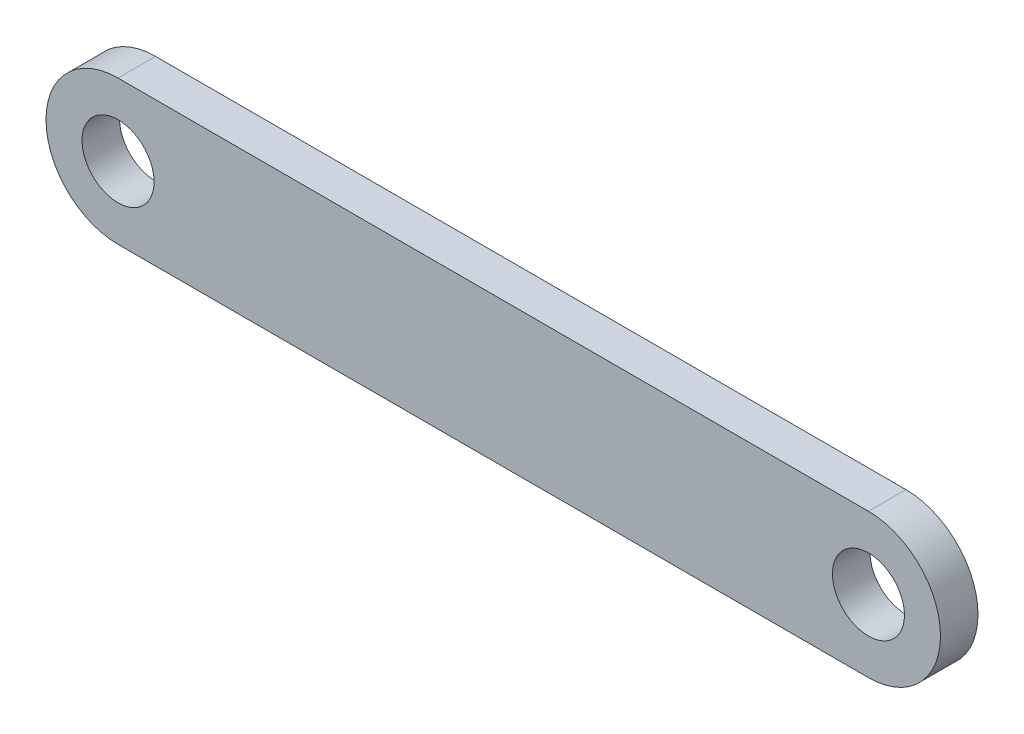
ISO-10303-21;
HEADER;
FILE_DESCRIPTION(('STEP AP214'),'2;1');
FILE_NAME('part.step','',(''),(''),'','','');
FILE_SCHEMA(('AUTOMOTIVE_DESIGN { 1 0 10303 214 1 1 1 1 }'));
ENDSEC;
DATA;
#1=APPLICATION_CONTEXT('core data for automotive mechanical design processes');
#2=APPLICATION_PROTOCOL_DEFINITION('international standard','automotive_design',2000,#1);
#3=PRODUCT_CONTEXT('',#1,'mechanical');
#4=PRODUCT('Part','Part','',(#3));
#5=PRODUCT_RELATED_PRODUCT_CATEGORY('part','',(#4));
#6=PRODUCT_DEFINITION_FORMATION('','',#4);
#7=PRODUCT_DEFINITION_CONTEXT('part definition',#1,'design');
#8=PRODUCT_DEFINITION('design','',#6,#7);
#9=PRODUCT_DEFINITION_SHAPE('','',#8);
#10=(LENGTH_UNIT() NAMED_UNIT(*) SI_UNIT(.MILLI.,.METRE.));
#11=(NAMED_UNIT(*) PLANE_ANGLE_UNIT() SI_UNIT($,.RADIAN.));
#12=(NAMED_UNIT(*) SI_UNIT($,.STERADIAN.) SOLID_ANGLE_UNIT());
#13=UNCERTAINTY_MEASURE_WITH_UNIT(LENGTH_MEASURE(1.E-05),#10,'distance_accuracy_value','');
#14=(GEOMETRIC_REPRESENTATION_CONTEXT(3) GLOBAL_UNCERTAINTY_ASSIGNED_CONTEXT((#13)) GLOBAL_UNIT_ASSIGNED_CONTEXT((#10,
#11,#12)) REPRESENTATION_CONTEXT('',''));
#15=CARTESIAN_POINT('',(0.,0.,0.));
#16=DIRECTION('',(0.,0.,1.));
#17=DIRECTION('',(1.,0.,0.));
#18=AXIS2_PLACEMENT_3D('',#15,#16,#17);
#19=CARTESIAN_POINT('',(0.,0.,3.125));
#20=DIRECTION('',(0.,0.,1.));
#21=DIRECTION('',(1.,0.,0.));
#22=AXIS2_PLACEMENT_3D('',#19,#20,#21);
#23=PLANE('',#22);
#24=CARTESIAN_POINT('',(0.,0.,3.125));
#25=DIRECTION('',(0.,0.,1.));
#26=DIRECTION('',(1.,0.,0.));
#27=AXIS2_PLACEMENT_3D('',#24,#25,#26);
#28=CIRCLE('',#27,6.);
#29=CARTESIAN_POINT('',(6.,0.,3.125));
#30=VERTEX_POINT('',#29);
#31=EDGE_CURVE('E102',#30,#30,#28,.T.);
#32=ORIENTED_EDGE('',*,*,#31,.F.);
#33=EDGE_LOOP('',(#32));
#34=FACE_BOUND('',#33,.T.);
#35=CARTESIAN_POINT('',(0.,0.,3.125));
#36=DIRECTION('',(0.,0.,1.));
#37=DIRECTION('',(1.,0.,0.));
#38=AXIS2_PLACEMENT_3D('',#35,#36,#37);
#39=CIRCLE('',#38,12.);
#40=CARTESIAN_POINT('',(0.,12.,3.125));
#41=VERTEX_POINT('',#40);
#42=CARTESIAN_POINT('',(0.,-12.,3.125));
#43=VERTEX_POINT('',#42);
#44=EDGE_CURVE('E87',#41,#43,#39,.T.);
#45=ORIENTED_EDGE('',*,*,#44,.T.);
#46=DIRECTION('',(1.,0.,0.));
#47=VECTOR('',#46,1.);
#48=CARTESIAN_POINT('',(0.,-12.,3.125));
#49=LINE('',#48,#47);
#50=CARTESIAN_POINT('',(125.,-12.,3.125));
#51=VERTEX_POINT('',#50);
#52=EDGE_CURVE('E82',#43,#51,#49,.T.);
#53=ORIENTED_EDGE('',*,*,#52,.T.);
#54=CARTESIAN_POINT('',(125.,0.,3.125));
#55=DIRECTION('',(0.,0.,1.));
#56=DIRECTION('',(1.,0.,0.));
#57=AXIS2_PLACEMENT_3D('',#54,#55,#56);
#58=CIRCLE('',#57,12.);
#59=CARTESIAN_POINT('',(125.,12.,3.125));
#60=VERTEX_POINT('',#59);
#61=EDGE_CURVE('E85',#51,#60,#58,.T.);
#62=ORIENTED_EDGE('',*,*,#61,.T.);
#63=DIRECTION('',(-1.,0.,0.));
#64=VECTOR('',#63,1.);
#65=CARTESIAN_POINT('',(0.,12.,3.125));
#66=LINE('',#65,#64);
#67=EDGE_CURVE('E52',#60,#41,#66,.T.);
#68=ORIENTED_EDGE('',*,*,#67,.T.);
#69=EDGE_LOOP('',(#45,#53,#62,#68));
#70=FACE_BOUND('',#69,.T.);
#71=CARTESIAN_POINT('',(125.,0.,3.125));
#72=DIRECTION('',(0.,0.,1.));
#73=DIRECTION('',(1.,0.,0.));
#74=AXIS2_PLACEMENT_3D('',#71,#72,#73);
#75=CIRCLE('',#74,6.00000000000002);
#76=CARTESIAN_POINT('',(131.,0.,3.125));
#77=VERTEX_POINT('',#76);
#78=EDGE_CURVE('E117',#77,#77,#75,.T.);
#79=ORIENTED_EDGE('',*,*,#78,.F.);
#80=EDGE_LOOP('',(#79));
#81=FACE_BOUND('',#80,.T.);
#82=ADVANCED_FACE('F35',(#34,#70,#81),#23,.T.);
#83=CARTESIAN_POINT('',(0.,0.,-3.125));
#84=DIRECTION('',(0.,0.,1.));
#85=DIRECTION('',(1.,0.,0.));
#86=AXIS2_PLACEMENT_3D('',#83,#84,#85);
#87=PLANE('',#86);
#88=CARTESIAN_POINT('',(0.,0.,-3.125));
#89=DIRECTION('',(0.,0.,1.));
#90=DIRECTION('',(1.,0.,0.));
#91=AXIS2_PLACEMENT_3D('',#88,#89,#90);
#92=CIRCLE('',#91,12.);
#93=CARTESIAN_POINT('',(0.,12.,-3.125));
#94=VERTEX_POINT('',#93);
#95=CARTESIAN_POINT('',(0.,-12.,-3.125));
#96=VERTEX_POINT('',#95);
#97=EDGE_CURVE('E99',#94,#96,#92,.T.);
#98=ORIENTED_EDGE('',*,*,#97,.F.);
#99=DIRECTION('',(-1.,0.,0.));
#100=VECTOR('',#99,1.);
#101=CARTESIAN_POINT('',(0.,12.,-3.125));
#102=LINE('',#101,#100);
#103=CARTESIAN_POINT('',(125.,12.,-3.125));
#104=VERTEX_POINT('',#103);
#105=EDGE_CURVE('E75',#104,#94,#102,.T.);
#106=ORIENTED_EDGE('',*,*,#105,.F.);
#107=CARTESIAN_POINT('',(125.,0.,-3.125));
#108=DIRECTION('',(0.,0.,1.));
#109=DIRECTION('',(1.,0.,0.));
#110=AXIS2_PLACEMENT_3D('',#107,#108,#109);
#111=CIRCLE('',#110,12.);
#112=CARTESIAN_POINT('',(125.,-12.,-3.125));
#113=VERTEX_POINT('',#112);
#114=EDGE_CURVE('E69',#113,#104,#111,.T.);
#115=ORIENTED_EDGE('',*,*,#114,.F.);
#116=DIRECTION('',(1.,0.,0.));
#117=VECTOR('',#116,1.);
#118=CARTESIAN_POINT('',(0.,-12.,-3.125));
#119=LINE('',#118,#117);
#120=EDGE_CURVE('E91',#96,#113,#119,.T.);
#121=ORIENTED_EDGE('',*,*,#120,.F.);
#122=EDGE_LOOP('',(#98,#106,#115,#121));
#123=FACE_BOUND('',#122,.T.);
#124=CARTESIAN_POINT('',(0.,0.,-3.125));
#125=DIRECTION('',(0.,0.,1.));
#126=DIRECTION('',(1.,0.,0.));
#127=AXIS2_PLACEMENT_3D('',#124,#125,#126);
#128=CIRCLE('',#127,6.);
#129=CARTESIAN_POINT('',(6.,0.,-3.125));
#130=VERTEX_POINT('',#129);
#131=EDGE_CURVE('E114',#130,#130,#128,.T.);
#132=ORIENTED_EDGE('',*,*,#131,.T.);
#133=EDGE_LOOP('',(#132));
#134=FACE_BOUND('',#133,.T.);
#135=CARTESIAN_POINT('',(125.,0.,-3.125));
#136=DIRECTION('',(0.,0.,1.));
#137=DIRECTION('',(1.,0.,0.));
#138=AXIS2_PLACEMENT_3D('',#135,#136,#137);
#139=CIRCLE('',#138,6.00000000000002);
#140=CARTESIAN_POINT('',(131.,0.,-3.125));
#141=VERTEX_POINT('',#140);
#142=EDGE_CURVE('E120',#141,#141,#139,.T.);
#143=ORIENTED_EDGE('',*,*,#142,.T.);
#144=EDGE_LOOP('',(#143));
#145=FACE_BOUND('',#144,.T.);
#146=ADVANCED_FACE('F110',(#123,#134,#145),#87,.F.);
#147=CARTESIAN_POINT('',(0.,0.,3.125));
#148=DIRECTION('',(0.,0.,-1.));
#149=DIRECTION('',(-1.,0.,0.));
#150=AXIS2_PLACEMENT_3D('',#147,#148,#149);
#151=CYLINDRICAL_SURFACE('',#150,12.);
#152=ORIENTED_EDGE('',*,*,#97,.T.);
#153=DIRECTION('',(0.,0.,-1.));
#154=VECTOR('',#153,1.);
#155=CARTESIAN_POINT('',(0.,-12.,3.125));
#156=LINE('',#155,#154);
#157=EDGE_CURVE('E11',#43,#96,#156,.T.);
#158=ORIENTED_EDGE('',*,*,#157,.F.);
#159=ORIENTED_EDGE('',*,*,#44,.F.);
#160=DIRECTION('',(0.,0.,-1.));
#161=VECTOR('',#160,1.);
#162=CARTESIAN_POINT('',(0.,12.,3.125));
#163=LINE('',#162,#161);
#164=EDGE_CURVE('E95',#41,#94,#163,.T.);
#165=ORIENTED_EDGE('',*,*,#164,.T.);
#166=EDGE_LOOP('',(#152,#158,#159,#165));
#167=FACE_BOUND('',#166,.T.);
#168=ADVANCED_FACE('F37',(#167),#151,.T.);
#169=CARTESIAN_POINT('',(0.,-12.,3.125));
#170=DIRECTION('',(0.,1.,0.));
#171=DIRECTION('',(-1.,0.,0.));
#172=AXIS2_PLACEMENT_3D('',#169,#170,#171);
#173=PLANE('',#172);
#174=ORIENTED_EDGE('',*,*,#120,.T.);
#175=DIRECTION('',(0.,0.,-1.));
#176=VECTOR('',#175,1.);
#177=CARTESIAN_POINT('',(125.,-12.,3.125));
#178=LINE('',#177,#176);
#179=EDGE_CURVE('E44',#51,#113,#178,.T.);
#180=ORIENTED_EDGE('',*,*,#179,.F.);
#181=ORIENTED_EDGE('',*,*,#52,.F.);
#182=ORIENTED_EDGE('',*,*,#157,.T.);
#183=EDGE_LOOP('',(#174,#180,#181,#182));
#184=FACE_BOUND('',#183,.T.);
#185=ADVANCED_FACE('F90',(#184),#173,.F.);
#186=CARTESIAN_POINT('',(125.,0.,3.125));
#187=DIRECTION('',(0.,0.,-1.));
#188=DIRECTION('',(-1.,0.,0.));
#189=AXIS2_PLACEMENT_3D('',#186,#187,#188);
#190=CYLINDRICAL_SURFACE('',#189,12.);
#191=ORIENTED_EDGE('',*,*,#114,.T.);
#192=DIRECTION('',(0.,0.,-1.));
#193=VECTOR('',#192,1.);
#194=CARTESIAN_POINT('',(125.,12.,3.125));
#195=LINE('',#194,#193);
#196=EDGE_CURVE('E92',#60,#104,#195,.T.);
#197=ORIENTED_EDGE('',*,*,#196,.F.);
#198=ORIENTED_EDGE('',*,*,#61,.F.);
#199=ORIENTED_EDGE('',*,*,#179,.T.);
#200=EDGE_LOOP('',(#191,#197,#198,#199));
#201=FACE_BOUND('',#200,.T.);
#202=ADVANCED_FACE('F93',(#201),#190,.T.);
#203=CARTESIAN_POINT('',(0.,12.,3.125));
#204=DIRECTION('',(0.,-1.,0.));
#205=DIRECTION('',(1.,0.,0.));
#206=AXIS2_PLACEMENT_3D('',#203,#204,#205);
#207=PLANE('',#206);
#208=ORIENTED_EDGE('',*,*,#105,.T.);
#209=ORIENTED_EDGE('',*,*,#164,.F.);
#210=ORIENTED_EDGE('',*,*,#67,.F.);
#211=ORIENTED_EDGE('',*,*,#196,.T.);
#212=EDGE_LOOP('',(#208,#209,#210,#211));
#213=FACE_BOUND('',#212,.T.);
#214=ADVANCED_FACE('F107',(#213),#207,.F.);
#215=CARTESIAN_POINT('',(0.,0.,3.125));
#216=DIRECTION('',(0.,0.,-1.));
#217=DIRECTION('',(-1.,0.,0.));
#218=AXIS2_PLACEMENT_3D('',#215,#216,#217);
#219=CYLINDRICAL_SURFACE('',#218,6.);
#220=ORIENTED_EDGE('',*,*,#31,.T.);
#221=EDGE_LOOP('',(#220));
#222=FACE_BOUND('',#221,.T.);
#223=ORIENTED_EDGE('',*,*,#131,.F.);
#224=EDGE_LOOP('',(#223));
#225=FACE_BOUND('',#224,.T.);
#226=ADVANCED_FACE('F137',(#222,#225),#219,.F.);
#227=CARTESIAN_POINT('',(125.,0.,3.125));
#228=DIRECTION('',(0.,0.,-1.));
#229=DIRECTION('',(-1.,0.,0.));
#230=AXIS2_PLACEMENT_3D('',#227,#228,#229);
#231=CYLINDRICAL_SURFACE('',#230,6.00000000000002);
#232=ORIENTED_EDGE('',*,*,#78,.T.);
#233=EDGE_LOOP('',(#232));
#234=FACE_BOUND('',#233,.T.);
#235=ORIENTED_EDGE('',*,*,#142,.F.);
#236=EDGE_LOOP('',(#235));
#237=FACE_BOUND('',#236,.T.);
#238=ADVANCED_FACE('F126',(#234,#237),#231,.F.);
#239=CLOSED_SHELL('',(#82,#146,#168,#185,#202,#214,#226,#238));
#240=MANIFOLD_SOLID_BREP('B2',#239);
#241=ADVANCED_BREP_SHAPE_REPRESENTATION('',(#18,#240),#14);
#242=SHAPE_DEFINITION_REPRESENTATION(#9,#241);
ENDSEC;
END-ISO-10303-21;
